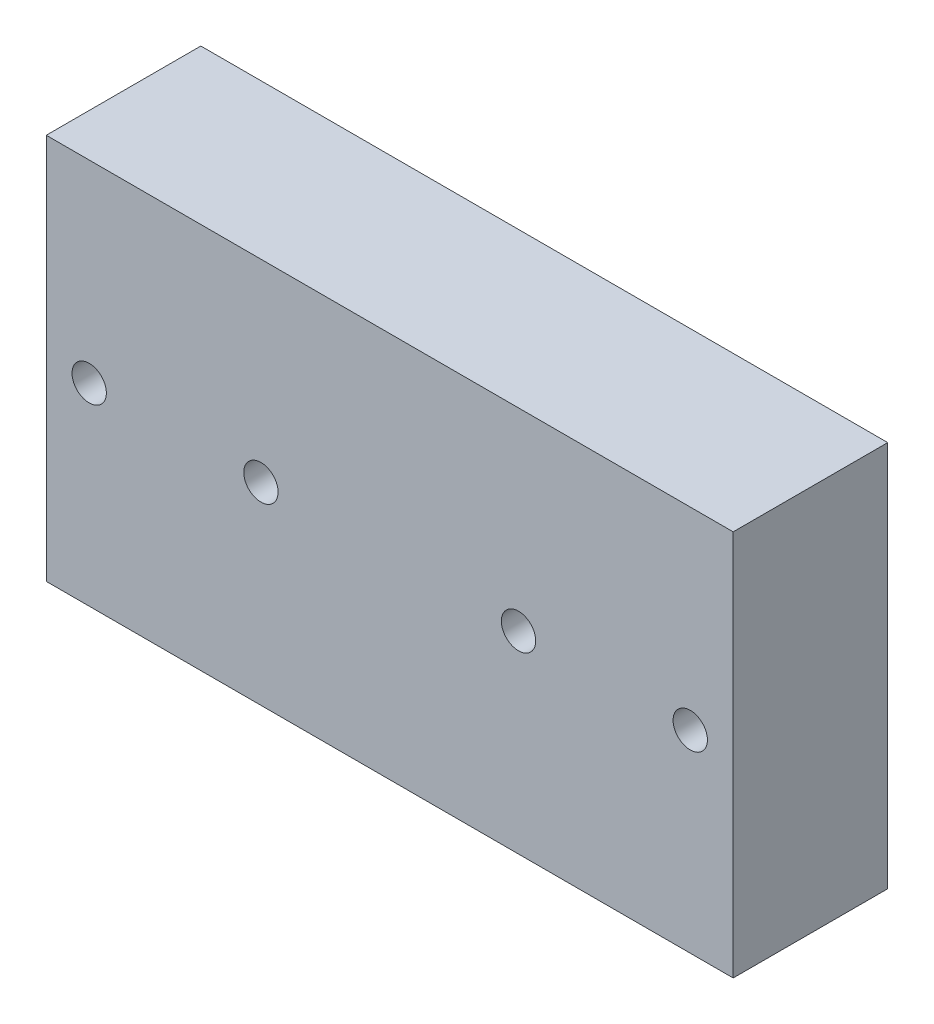
ISO-10303-21;
HEADER;
FILE_DESCRIPTION(('STEP AP214'),'2;1');
FILE_NAME('part.step','',(''),(''),'','','');
FILE_SCHEMA(('AUTOMOTIVE_DESIGN { 1 0 10303 214 1 1 1 1 }'));
ENDSEC;
DATA;
#1=APPLICATION_CONTEXT('core data for automotive mechanical design processes');
#2=APPLICATION_PROTOCOL_DEFINITION('international standard','automotive_design',2000,#1);
#3=PRODUCT_CONTEXT('',#1,'mechanical');
#4=PRODUCT('Part','Part','',(#3));
#5=PRODUCT_RELATED_PRODUCT_CATEGORY('part','',(#4));
#6=PRODUCT_DEFINITION_FORMATION('','',#4);
#7=PRODUCT_DEFINITION_CONTEXT('part definition',#1,'design');
#8=PRODUCT_DEFINITION('design','',#6,#7);
#9=PRODUCT_DEFINITION_SHAPE('','',#8);
#10=(LENGTH_UNIT() NAMED_UNIT(*) SI_UNIT(.MILLI.,.METRE.));
#11=(NAMED_UNIT(*) PLANE_ANGLE_UNIT() SI_UNIT($,.RADIAN.));
#12=(NAMED_UNIT(*) SI_UNIT($,.STERADIAN.) SOLID_ANGLE_UNIT());
#13=UNCERTAINTY_MEASURE_WITH_UNIT(LENGTH_MEASURE(1.E-05),#10,'distance_accuracy_value','');
#14=(GEOMETRIC_REPRESENTATION_CONTEXT(3) GLOBAL_UNCERTAINTY_ASSIGNED_CONTEXT((#13)) GLOBAL_UNIT_ASSIGNED_CONTEXT((#10,
#11,#12)) REPRESENTATION_CONTEXT('',''));
#15=CARTESIAN_POINT('',(0.,0.,0.));
#16=DIRECTION('',(0.,0.,1.));
#17=DIRECTION('',(1.,0.,0.));
#18=AXIS2_PLACEMENT_3D('',#15,#16,#17);
#19=CARTESIAN_POINT('',(0.,0.,18.));
#20=DIRECTION('',(0.,0.,-1.));
#21=DIRECTION('',(-1.,0.,0.));
#22=AXIS2_PLACEMENT_3D('',#19,#20,#21);
#23=PLANE('',#22);
#24=DIRECTION('',(0.,-1.,0.));
#25=VECTOR('',#24,1.);
#26=CARTESIAN_POINT('',(-40.,-22.5,18.));
#27=LINE('',#26,#25);
#28=CARTESIAN_POINT('',(-40.,22.5,18.));
#29=VERTEX_POINT('',#28);
#30=CARTESIAN_POINT('',(-40.,-22.5,18.));
#31=VERTEX_POINT('',#30);
#32=EDGE_CURVE('E85',#29,#31,#27,.T.);
#33=ORIENTED_EDGE('',*,*,#32,.T.);
#34=DIRECTION('',(1.,0.,0.));
#35=VECTOR('',#34,1.);
#36=CARTESIAN_POINT('',(-40.,-22.5,18.));
#37=LINE('',#36,#35);
#38=CARTESIAN_POINT('',(40.,-22.5,18.));
#39=VERTEX_POINT('',#38);
#40=EDGE_CURVE('E80',#31,#39,#37,.T.);
#41=ORIENTED_EDGE('',*,*,#40,.T.);
#42=DIRECTION('',(0.,1.,0.));
#43=VECTOR('',#42,1.);
#44=CARTESIAN_POINT('',(40.,-22.5,18.));
#45=LINE('',#44,#43);
#46=CARTESIAN_POINT('',(40.,22.5,18.));
#47=VERTEX_POINT('',#46);
#48=EDGE_CURVE('E83',#39,#47,#45,.T.);
#49=ORIENTED_EDGE('',*,*,#48,.T.);
#50=DIRECTION('',(-1.,0.,0.));
#51=VECTOR('',#50,1.);
#52=CARTESIAN_POINT('',(-40.,22.5,18.));
#53=LINE('',#52,#51);
#54=EDGE_CURVE('E50',#47,#29,#53,.T.);
#55=ORIENTED_EDGE('',*,*,#54,.T.);
#56=EDGE_LOOP('',(#33,#41,#49,#55));
#57=FACE_BOUND('',#56,.T.);
#58=CARTESIAN_POINT('',(35.,0.,18.));
#59=DIRECTION('',(0.,0.,1.));
#60=DIRECTION('',(1.,0.,0.));
#61=AXIS2_PLACEMENT_3D('',#58,#59,#60);
#62=CIRCLE('',#61,2.);
#63=CARTESIAN_POINT('',(37.,0.,18.));
#64=VERTEX_POINT('',#63);
#65=EDGE_CURVE('E100',#64,#64,#62,.T.);
#66=ORIENTED_EDGE('',*,*,#65,.F.);
#67=EDGE_LOOP('',(#66));
#68=FACE_BOUND('',#67,.T.);
#69=CARTESIAN_POINT('',(15.0000000000038,0.,18.));
#70=DIRECTION('',(0.,0.,1.));
#71=DIRECTION('',(-1.,0.,0.));
#72=AXIS2_PLACEMENT_3D('',#69,#70,#71);
#73=CIRCLE('',#72,2.);
#74=CARTESIAN_POINT('',(13.0000000000038,0.,18.));
#75=VERTEX_POINT('',#74);
#76=EDGE_CURVE('E115',#75,#75,#73,.T.);
#77=ORIENTED_EDGE('',*,*,#76,.F.);
#78=EDGE_LOOP('',(#77));
#79=FACE_BOUND('',#78,.T.);
#80=CARTESIAN_POINT('',(-15.0000000000038,0.,18.));
#81=DIRECTION('',(0.,0.,1.));
#82=DIRECTION('',(1.,0.,0.));
#83=AXIS2_PLACEMENT_3D('',#80,#81,#82);
#84=CIRCLE('',#83,2.);
#85=CARTESIAN_POINT('',(-13.0000000000038,0.,18.));
#86=VERTEX_POINT('',#85);
#87=EDGE_CURVE('E121',#86,#86,#84,.T.);
#88=ORIENTED_EDGE('',*,*,#87,.F.);
#89=EDGE_LOOP('',(#88));
#90=FACE_BOUND('',#89,.T.);
#91=CARTESIAN_POINT('',(-35.,-2.22044604925031E-13,18.));
#92=DIRECTION('',(0.,0.,1.));
#93=DIRECTION('',(-1.,0.,0.));
#94=AXIS2_PLACEMENT_3D('',#91,#92,#93);
#95=CIRCLE('',#94,2.00000000000002);
#96=CARTESIAN_POINT('',(-37.,-2.22044604925031E-13,18.));
#97=VERTEX_POINT('',#96);
#98=EDGE_CURVE('E127',#97,#97,#95,.T.);
#99=ORIENTED_EDGE('',*,*,#98,.F.);
#100=EDGE_LOOP('',(#99));
#101=FACE_BOUND('',#100,.T.);
#102=ADVANCED_FACE('F33',(#57,#68,#79,#90,#101),#23,.F.);
#103=CARTESIAN_POINT('',(0.,0.,0.));
#104=DIRECTION('',(0.,0.,-1.));
#105=DIRECTION('',(-1.,0.,0.));
#106=AXIS2_PLACEMENT_3D('',#103,#104,#105);
#107=PLANE('',#106);
#108=CARTESIAN_POINT('',(-15.0000000000038,0.,0.));
#109=DIRECTION('',(0.,0.,1.));
#110=DIRECTION('',(1.,0.,0.));
#111=AXIS2_PLACEMENT_3D('',#108,#109,#110);
#112=CIRCLE('',#111,2.);
#113=CARTESIAN_POINT('',(-13.0000000000038,0.,0.));
#114=VERTEX_POINT('',#113);
#115=EDGE_CURVE('E124',#114,#114,#112,.T.);
#116=ORIENTED_EDGE('',*,*,#115,.T.);
#117=EDGE_LOOP('',(#116));
#118=FACE_BOUND('',#117,.T.);
#119=CARTESIAN_POINT('',(35.,0.,0.));
#120=DIRECTION('',(0.,0.,1.));
#121=DIRECTION('',(1.,0.,0.));
#122=AXIS2_PLACEMENT_3D('',#119,#120,#121);
#123=CIRCLE('',#122,2.);
#124=CARTESIAN_POINT('',(37.,0.,0.));
#125=VERTEX_POINT('',#124);
#126=EDGE_CURVE('E112',#125,#125,#123,.T.);
#127=ORIENTED_EDGE('',*,*,#126,.T.);
#128=EDGE_LOOP('',(#127));
#129=FACE_BOUND('',#128,.T.);
#130=DIRECTION('',(0.,-1.,0.));
#131=VECTOR('',#130,1.);
#132=CARTESIAN_POINT('',(-40.,-22.5,0.));
#133=LINE('',#132,#131);
#134=CARTESIAN_POINT('',(-40.,22.5,0.));
#135=VERTEX_POINT('',#134);
#136=CARTESIAN_POINT('',(-40.,-22.5,0.));
#137=VERTEX_POINT('',#136);
#138=EDGE_CURVE('E97',#135,#137,#133,.T.);
#139=ORIENTED_EDGE('',*,*,#138,.F.);
#140=DIRECTION('',(-1.,0.,0.));
#141=VECTOR('',#140,1.);
#142=CARTESIAN_POINT('',(-40.,22.5,0.));
#143=LINE('',#142,#141);
#144=CARTESIAN_POINT('',(40.,22.5,0.));
#145=VERTEX_POINT('',#144);
#146=EDGE_CURVE('E73',#145,#135,#143,.T.);
#147=ORIENTED_EDGE('',*,*,#146,.F.);
#148=DIRECTION('',(0.,1.,0.));
#149=VECTOR('',#148,1.);
#150=CARTESIAN_POINT('',(40.,-22.5,0.));
#151=LINE('',#150,#149);
#152=CARTESIAN_POINT('',(40.,-22.5,0.));
#153=VERTEX_POINT('',#152);
#154=EDGE_CURVE('E67',#153,#145,#151,.T.);
#155=ORIENTED_EDGE('',*,*,#154,.F.);
#156=DIRECTION('',(1.,0.,0.));
#157=VECTOR('',#156,1.);
#158=CARTESIAN_POINT('',(-40.,-22.5,0.));
#159=LINE('',#158,#157);
#160=EDGE_CURVE('E89',#137,#153,#159,.T.);
#161=ORIENTED_EDGE('',*,*,#160,.F.);
#162=EDGE_LOOP('',(#139,#147,#155,#161));
#163=FACE_BOUND('',#162,.T.);
#164=CARTESIAN_POINT('',(15.0000000000038,0.,0.));
#165=DIRECTION('',(0.,0.,1.));
#166=DIRECTION('',(-1.,0.,0.));
#167=AXIS2_PLACEMENT_3D('',#164,#165,#166);
#168=CIRCLE('',#167,2.);
#169=CARTESIAN_POINT('',(13.0000000000038,0.,0.));
#170=VERTEX_POINT('',#169);
#171=EDGE_CURVE('E118',#170,#170,#168,.T.);
#172=ORIENTED_EDGE('',*,*,#171,.T.);
#173=EDGE_LOOP('',(#172));
#174=FACE_BOUND('',#173,.T.);
#175=CARTESIAN_POINT('',(-35.,-2.22044604925031E-13,0.));
#176=DIRECTION('',(0.,0.,1.));
#177=DIRECTION('',(-1.,0.,0.));
#178=AXIS2_PLACEMENT_3D('',#175,#176,#177);
#179=CIRCLE('',#178,2.00000000000002);
#180=CARTESIAN_POINT('',(-37.,-2.22044604925031E-13,0.));
#181=VERTEX_POINT('',#180);
#182=EDGE_CURVE('E130',#181,#181,#179,.T.);
#183=ORIENTED_EDGE('',*,*,#182,.T.);
#184=EDGE_LOOP('',(#183));
#185=FACE_BOUND('',#184,.T.);
#186=ADVANCED_FACE('F108',(#118,#129,#163,#174,#185),#107,.T.);
#187=CARTESIAN_POINT('',(-40.,-22.5,18.));
#188=DIRECTION('',(1.,0.,0.));
#189=DIRECTION('',(0.,1.,0.));
#190=AXIS2_PLACEMENT_3D('',#187,#188,#189);
#191=PLANE('',#190);
#192=ORIENTED_EDGE('',*,*,#138,.T.);
#193=DIRECTION('',(0.,0.,-1.));
#194=VECTOR('',#193,1.);
#195=CARTESIAN_POINT('',(-40.,-22.5,18.));
#196=LINE('',#195,#194);
#197=EDGE_CURVE('E11',#31,#137,#196,.T.);
#198=ORIENTED_EDGE('',*,*,#197,.F.);
#199=ORIENTED_EDGE('',*,*,#32,.F.);
#200=DIRECTION('',(0.,0.,-1.));
#201=VECTOR('',#200,1.);
#202=CARTESIAN_POINT('',(-40.,22.5,18.));
#203=LINE('',#202,#201);
#204=EDGE_CURVE('E93',#29,#135,#203,.T.);
#205=ORIENTED_EDGE('',*,*,#204,.T.);
#206=EDGE_LOOP('',(#192,#198,#199,#205));
#207=FACE_BOUND('',#206,.T.);
#208=ADVANCED_FACE('F35',(#207),#191,.F.);
#209=CARTESIAN_POINT('',(-40.,-22.5,18.));
#210=DIRECTION('',(0.,1.,0.));
#211=DIRECTION('',(0.,0.,1.));
#212=AXIS2_PLACEMENT_3D('',#209,#210,#211);
#213=PLANE('',#212);
#214=ORIENTED_EDGE('',*,*,#160,.T.);
#215=DIRECTION('',(0.,0.,-1.));
#216=VECTOR('',#215,1.);
#217=CARTESIAN_POINT('',(40.,-22.5,18.));
#218=LINE('',#217,#216);
#219=EDGE_CURVE('E42',#39,#153,#218,.T.);
#220=ORIENTED_EDGE('',*,*,#219,.F.);
#221=ORIENTED_EDGE('',*,*,#40,.F.);
#222=ORIENTED_EDGE('',*,*,#197,.T.);
#223=EDGE_LOOP('',(#214,#220,#221,#222));
#224=FACE_BOUND('',#223,.T.);
#225=ADVANCED_FACE('F88',(#224),#213,.F.);
#226=CARTESIAN_POINT('',(40.,-22.5,18.));
#227=DIRECTION('',(-1.,0.,0.));
#228=DIRECTION('',(0.,-1.,0.));
#229=AXIS2_PLACEMENT_3D('',#226,#227,#228);
#230=PLANE('',#229);
#231=ORIENTED_EDGE('',*,*,#154,.T.);
#232=DIRECTION('',(0.,0.,-1.));
#233=VECTOR('',#232,1.);
#234=CARTESIAN_POINT('',(40.,22.5,18.));
#235=LINE('',#234,#233);
#236=EDGE_CURVE('E90',#47,#145,#235,.T.);
#237=ORIENTED_EDGE('',*,*,#236,.F.);
#238=ORIENTED_EDGE('',*,*,#48,.F.);
#239=ORIENTED_EDGE('',*,*,#219,.T.);
#240=EDGE_LOOP('',(#231,#237,#238,#239));
#241=FACE_BOUND('',#240,.T.);
#242=ADVANCED_FACE('F91',(#241),#230,.F.);
#243=CARTESIAN_POINT('',(-40.,22.5,18.));
#244=DIRECTION('',(0.,-1.,0.));
#245=DIRECTION('',(1.,0.,0.));
#246=AXIS2_PLACEMENT_3D('',#243,#244,#245);
#247=PLANE('',#246);
#248=ORIENTED_EDGE('',*,*,#146,.T.);
#249=ORIENTED_EDGE('',*,*,#204,.F.);
#250=ORIENTED_EDGE('',*,*,#54,.F.);
#251=ORIENTED_EDGE('',*,*,#236,.T.);
#252=EDGE_LOOP('',(#248,#249,#250,#251));
#253=FACE_BOUND('',#252,.T.);
#254=ADVANCED_FACE('F105',(#253),#247,.F.);
#255=CARTESIAN_POINT('',(35.,0.,18.));
#256=DIRECTION('',(0.,0.,-1.));
#257=DIRECTION('',(-1.,0.,0.));
#258=AXIS2_PLACEMENT_3D('',#255,#256,#257);
#259=CYLINDRICAL_SURFACE('',#258,2.);
#260=ORIENTED_EDGE('',*,*,#65,.T.);
#261=EDGE_LOOP('',(#260));
#262=FACE_BOUND('',#261,.T.);
#263=ORIENTED_EDGE('',*,*,#126,.F.);
#264=EDGE_LOOP('',(#263));
#265=FACE_BOUND('',#264,.T.);
#266=ADVANCED_FACE('F147',(#262,#265),#259,.F.);
#267=CARTESIAN_POINT('',(15.0000000000038,0.,18.));
#268=DIRECTION('',(0.,0.,-1.));
#269=DIRECTION('',(-1.,0.,0.));
#270=AXIS2_PLACEMENT_3D('',#267,#268,#269);
#271=CYLINDRICAL_SURFACE('',#270,2.);
#272=ORIENTED_EDGE('',*,*,#76,.T.);
#273=EDGE_LOOP('',(#272));
#274=FACE_BOUND('',#273,.T.);
#275=ORIENTED_EDGE('',*,*,#171,.F.);
#276=EDGE_LOOP('',(#275));
#277=FACE_BOUND('',#276,.T.);
#278=ADVANCED_FACE('F193',(#274,#277),#271,.F.);
#279=CARTESIAN_POINT('',(-15.0000000000038,0.,18.));
#280=DIRECTION('',(0.,0.,-1.));
#281=DIRECTION('',(-1.,0.,0.));
#282=AXIS2_PLACEMENT_3D('',#279,#280,#281);
#283=CYLINDRICAL_SURFACE('',#282,2.);
#284=ORIENTED_EDGE('',*,*,#87,.T.);
#285=EDGE_LOOP('',(#284));
#286=FACE_BOUND('',#285,.T.);
#287=ORIENTED_EDGE('',*,*,#115,.F.);
#288=EDGE_LOOP('',(#287));
#289=FACE_BOUND('',#288,.T.);
#290=ADVANCED_FACE('F201',(#286,#289),#283,.F.);
#291=CARTESIAN_POINT('',(-35.,-2.22044604925031E-13,18.));
#292=DIRECTION('',(0.,0.,-1.));
#293=DIRECTION('',(-1.,0.,0.));
#294=AXIS2_PLACEMENT_3D('',#291,#292,#293);
#295=CYLINDRICAL_SURFACE('',#294,2.00000000000002);
#296=ORIENTED_EDGE('',*,*,#98,.T.);
#297=EDGE_LOOP('',(#296));
#298=FACE_BOUND('',#297,.T.);
#299=ORIENTED_EDGE('',*,*,#182,.F.);
#300=EDGE_LOOP('',(#299));
#301=FACE_BOUND('',#300,.T.);
#302=ADVANCED_FACE('F136',(#298,#301),#295,.F.);
#303=CLOSED_SHELL('',(#102,#186,#208,#225,#242,#254,#266,#278,#290,#302));
#304=MANIFOLD_SOLID_BREP('B2',#303);
#305=ADVANCED_BREP_SHAPE_REPRESENTATION('',(#18,#304),#14);
#306=SHAPE_DEFINITION_REPRESENTATION(#9,#305);
ENDSEC;
END-ISO-10303-21;
